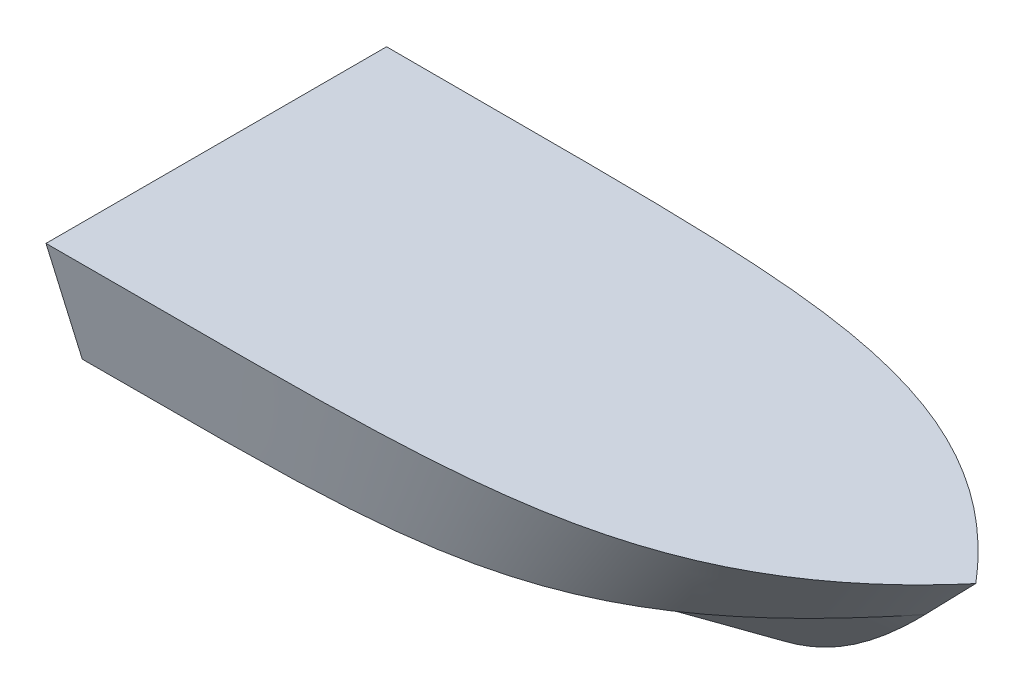
ISO-10303-21;
HEADER;
FILE_DESCRIPTION(('STEP AP214'),'2;1');
FILE_NAME('part.step','',(''),(''),'','','');
FILE_SCHEMA(('AUTOMOTIVE_DESIGN { 1 0 10303 214 1 1 1 1 }'));
ENDSEC;
DATA;
#1=APPLICATION_CONTEXT('core data for automotive mechanical design processes');
#2=APPLICATION_PROTOCOL_DEFINITION('international standard','automotive_design',2000,#1);
#3=PRODUCT_CONTEXT('',#1,'mechanical');
#4=PRODUCT('Part','Part','',(#3));
#5=PRODUCT_RELATED_PRODUCT_CATEGORY('part','',(#4));
#6=PRODUCT_DEFINITION_FORMATION('','',#4);
#7=PRODUCT_DEFINITION_CONTEXT('part definition',#1,'design');
#8=PRODUCT_DEFINITION('design','',#6,#7);
#9=PRODUCT_DEFINITION_SHAPE('','',#8);
#10=(LENGTH_UNIT() NAMED_UNIT(*) SI_UNIT(.MILLI.,.METRE.));
#11=(NAMED_UNIT(*) PLANE_ANGLE_UNIT() SI_UNIT($,.RADIAN.));
#12=(NAMED_UNIT(*) SI_UNIT($,.STERADIAN.) SOLID_ANGLE_UNIT());
#13=UNCERTAINTY_MEASURE_WITH_UNIT(LENGTH_MEASURE(1.E-05),#10,'distance_accuracy_value','');
#14=(GEOMETRIC_REPRESENTATION_CONTEXT(3) GLOBAL_UNCERTAINTY_ASSIGNED_CONTEXT((#13)) GLOBAL_UNIT_ASSIGNED_CONTEXT((#10,
#11,#12)) REPRESENTATION_CONTEXT('',''));
#15=CARTESIAN_POINT('',(0.,0.,0.));
#16=DIRECTION('',(0.,0.,1.));
#17=DIRECTION('',(1.,0.,0.));
#18=AXIS2_PLACEMENT_3D('',#15,#16,#17);
#19=CARTESIAN_POINT('',(3126.38132717579,975.137042122445,1.4531255390156));
#20=CARTESIAN_POINT('',(3126.38132717579,975.59564461762,0.0131255390155955));
#21=CARTESIAN_POINT('',(3126.38132717579,1021.45589413516,-143.986874460984));
#22=CARTESIAN_POINT('',(3681.07733472291,975.137042122445,1.4531255390156));
#23=CARTESIAN_POINT('',(3677.18132717579,975.59564461762,0.0131255390155955));
#24=CARTESIAN_POINT('',(3287.58057246419,1021.45589413516,-143.986874460984));
#25=CARTESIAN_POINT('',(3741.27734227003,975.137042122445,1.4531255390156));
#26=CARTESIAN_POINT('',(3738.38132717579,975.59564461762,0.0131255390155955));
#27=CARTESIAN_POINT('',(3448.77981775258,1021.45589413516,-143.986874460985));
#28=CARTESIAN_POINT('',(3801.47734981714,975.137042122445,1.4531255390156));
#29=CARTESIAN_POINT('',(3799.58132717579,975.59564461762,0.0131255390155955));
#30=CARTESIAN_POINT('',(3609.97906304097,1021.45589413516,-143.986874460984));
#31=CARTESIAN_POINT('',(3861.67735736426,974.790890222072,1.4531255390156));
#32=CARTESIAN_POINT('',(3860.78132717579,975.59564461762,0.0131255390155955));
#33=CARTESIAN_POINT('',(3771.17830832936,1056.07108417245,-143.986874460984));
#34=CARTESIAN_POINT('',(3983.18132717579,1101.59564461762,0.0131255390155955));
#35=CARTESIAN_POINT('',(3983.18132717579,1101.59564461762,0.0131255390155955));
#36=CARTESIAN_POINT('',(3983.18132717579,1101.59564461762,0.0131255390155955));
#37=B_SPLINE_SURFACE_WITH_KNOTS('',5,1,((#19,#20,#21),(#22,#23,#24),(#25,#26,#27),(#28,#29,#30),
(#31,#32,#33),(#34,#35,#36)),.UNSPECIFIED.,.F.,.F.,.F.,(6,6),(2,1,2),(0.,8897.05627484771),
(-12.7701332697109,0.,1277.01332697109),.UNSPECIFIED.);
#38=CARTESIAN_POINT('',(3202.58132717579,983.684883074159,-25.3867423808738));
#39=CARTESIAN_POINT('',(3202.58132717579,980.988471055763,-16.9201194859876));
#40=CARTESIAN_POINT('',(3202.58132717579,978.292059037366,-8.45349659110136));
#41=CARTESIAN_POINT('',(3202.58132717579,975.59564701897,0.0131263037848661));
#42=B_SPLINE_CURVE_WITH_KNOTS('',3,(#38,#39,#40,#41),.UNSPECIFIED.,.F.,.F.,(4,4),(0.,
26.6568765828721),.UNSPECIFIED.);
#43=CARTESIAN_POINT('',(3202.58132717579,983.68484488364,-25.3867545436529));
#44=VERTEX_POINT('',#43);
#45=CARTESIAN_POINT('',(3202.58132717579,975.59564701897,0.0131255390154215));
#46=VERTEX_POINT('',#45);
#47=EDGE_CURVE('E70',#44,#46,#42,.T.);
#48=CARTESIAN_POINT('',(3202.5813271757,983.684921264972,-25.3868622981204));
#49=CARTESIAN_POINT('',(3199.5604793122,983.684914285715,-25.3868629841229));
#50=CARTESIAN_POINT('',(3196.5396314487,983.684908698163,-25.386863613535));
#51=CARTESIAN_POINT('',(3190.45501729085,983.684899582818,-25.3868647986574));
#52=CARTESIAN_POINT('',(3187.3912509965,983.684896085415,-25.3868653531936));
#53=CARTESIAN_POINT('',(3181.2202434461,983.684890548577,-25.3868664178219));
#54=CARTESIAN_POINT('',(3178.11300219004,983.684888530533,-25.3868669271717));
#55=CARTESIAN_POINT('',(3171.85448341421,983.684885493271,-25.3868679199163));
#56=CARTESIAN_POINT('',(3168.70320589443,983.684884488613,-25.386868402841));
#57=CARTESIAN_POINT('',(3162.3560484944,983.684883101906,-25.3868693557301));
#58=CARTESIAN_POINT('',(3159.16016861416,983.684882728869,-25.3868698254144));
#59=CARTESIAN_POINT('',(3152.72323557821,983.684882324725,-25.3868707594717));
#60=CARTESIAN_POINT('',(3149.4821824225,983.684882298526,-25.3868712236759));
#61=CARTESIAN_POINT('',(3142.95432707883,983.684882386962,-25.3868721507675));
#62=CARTESIAN_POINT('',(3139.66752489086,983.684882503591,-25.3868726135437));
#63=CARTESIAN_POINT('',(3133.04759086053,983.684882781469,-25.386873538859));
#64=CARTESIAN_POINT('',(3129.71445901816,983.684882943326,-25.3868740013027));
#65=CARTESIAN_POINT('',(3126.38132717579,983.684883074187,-25.3868744609844));
#66=B_SPLINE_CURVE_WITH_KNOTS('',3,(#48,#49,#50,#51,#52,#53,#54,#55,#56,#57,#58,#59,#60,#61,#62,
#63,#64,#65),.UNSPECIFIED.,.F.,.F.,(4,2,2,2,2,2,2,2,4),(0.,9.06254359051395,18.2538424735734,
27.5755662417392,37.0293988010793,46.6170384418139,56.3401979089336,66.2006044728311,
76.1999999999344),.UNSPECIFIED.);
#67=CARTESIAN_POINT('',(3126.38132717579,983.684883074187,-25.3868744609844));
#68=VERTEX_POINT('',#67);
#69=EDGE_CURVE('E12',#44,#68,#66,.T.);
#70=DIRECTION('',(0.,-0.303456417365817,0.952845319429918));
#71=VECTOR('',#70,1.);
#72=CARTESIAN_POINT('',(3126.38132717579,1021.45589413516,-143.986874460984));
#73=LINE('',#72,#71);
#74=CARTESIAN_POINT('',(3126.38132717579,1021.45589413516,-143.986874460984));
#75=VERTEX_POINT('',#74);
#76=EDGE_CURVE('E131',#75,#68,#73,.T.);
#77=CARTESIAN_POINT('',(3126.38132717579,1021.45589413516,-143.986874460984));
#78=CARTESIAN_POINT('',(3287.58057246419,1021.45589413516,-143.986874460984));
#79=CARTESIAN_POINT('',(3448.77981775258,1021.45589413516,-143.986874460985));
#80=CARTESIAN_POINT('',(3609.97906304097,1021.45589413516,-143.986874460984));
#81=CARTESIAN_POINT('',(3771.17830832936,1056.07108417245,-143.986874460984));
#82=CARTESIAN_POINT('',(3983.18132717579,1101.59564461762,0.0131255390155955));
#83=B_SPLINE_CURVE_WITH_KNOTS('',5,(#77,#78,#79,#80,#81,#82),.UNSPECIFIED.,.F.,.F.,(6,6),(0.,
8897.05627484771),.UNSPECIFIED.);
#84=CARTESIAN_POINT('',(3983.18132717579,1101.59564461762,0.0131255390155955));
#85=VERTEX_POINT('',#84);
#86=EDGE_CURVE('E121',#85,#75,#83,.F.);
#87=CARTESIAN_POINT('',(3126.38132717579,975.59564461762,0.0131255390155955));
#88=CARTESIAN_POINT('',(3677.18132717579,975.59564461762,0.0131255390155955));
#89=CARTESIAN_POINT('',(3738.38132717579,975.59564461762,0.0131255390155955));
#90=CARTESIAN_POINT('',(3799.58132717579,975.59564461762,0.0131255390155955));
#91=CARTESIAN_POINT('',(3860.78132717579,975.59564461762,0.0131255390155955));
#92=CARTESIAN_POINT('',(3983.18132717579,1101.59564461762,0.0131255390155955));
#93=B_SPLINE_CURVE_WITH_KNOTS('',5,(#87,#88,#89,#90,#91,#92),.UNSPECIFIED.,.F.,.F.,(6,6),(0.,
8897.05627484771),.UNSPECIFIED.);
#94=EDGE_CURVE('E137',#46,#85,#93,.T.);
#95=ORIENTED_EDGE('',*,*,#47,.F.);
#96=ORIENTED_EDGE('',*,*,#69,.T.);
#97=ORIENTED_EDGE('',*,*,#76,.F.);
#98=ORIENTED_EDGE('',*,*,#86,.F.);
#99=ORIENTED_EDGE('',*,*,#94,.F.);
#100=EDGE_LOOP('',(#95,#96,#97,#98,#99));
#101=FACE_BOUND('',#100,.T.);
#102=ADVANCED_FACE('F53',(#101),#37,.F.);
#103=CARTESIAN_POINT('',(3126.38132717579,975.59564461762,0.0131255390155955));
#104=DIRECTION('',(1.,0.,0.));
#105=DIRECTION('',(0.,0.,-1.));
#106=AXIS2_PLACEMENT_3D('',#103,#104,#105);
#107=PLANE('',#106);
#108=DIRECTION('',(0.,0.,1.));
#109=VECTOR('',#108,1.);
#110=CARTESIAN_POINT('',(3126.38132717579,983.684883074187,-25.3868744609844));
#111=LINE('',#110,#109);
#112=CARTESIAN_POINT('',(3126.38132717579,983.684883074187,25.4131255390156));
#113=VERTEX_POINT('',#112);
#114=EDGE_CURVE('E116',#68,#113,#111,.T.);
#115=ORIENTED_EDGE('',*,*,#114,.T.);
#116=DIRECTION('',(0.,-0.303456417365817,-0.952845319429918));
#117=VECTOR('',#116,1.);
#118=CARTESIAN_POINT('',(3126.38132717579,1021.45589413516,144.013125539016));
#119=LINE('',#118,#117);
#120=CARTESIAN_POINT('',(3126.38132717579,1021.45589413516,144.013125539016));
#121=VERTEX_POINT('',#120);
#122=EDGE_CURVE('E128',#121,#113,#119,.T.);
#123=ORIENTED_EDGE('',*,*,#122,.F.);
#124=DIRECTION('',(0.,0.,-1.));
#125=VECTOR('',#124,1.);
#126=CARTESIAN_POINT('',(3126.38132717579,1021.45589413516,162.013125539016));
#127=LINE('',#126,#125);
#128=CARTESIAN_POINT('',(3126.38132717579,1021.45589413516,162.013125539016));
#129=VERTEX_POINT('',#128);
#130=EDGE_CURVE('E163',#129,#121,#127,.T.);
#131=ORIENTED_EDGE('',*,*,#130,.F.);
#132=DIRECTION('',(0.,-0.956171796943736,-0.292806240933126));
#133=VECTOR('',#132,1.);
#134=CARTESIAN_POINT('',(3126.38132717579,1093.02576937639,183.929800137054));
#135=LINE('',#134,#133);
#136=CARTESIAN_POINT('',(3126.38132717579,1164.59564461762,205.846474735093));
#137=VERTEX_POINT('',#136);
#138=EDGE_CURVE('E173',#137,#129,#135,.T.);
#139=ORIENTED_EDGE('',*,*,#138,.F.);
#140=DIRECTION('',(0.,0.,1.));
#141=VECTOR('',#140,1.);
#142=CARTESIAN_POINT('',(3126.38132717579,1164.59564461762,0.0131255390155955));
#143=LINE('',#142,#141);
#144=CARTESIAN_POINT('',(3126.38132717579,1164.59564461762,-205.820223657062));
#145=VERTEX_POINT('',#144);
#146=EDGE_CURVE('E182',#145,#137,#143,.T.);
#147=ORIENTED_EDGE('',*,*,#146,.F.);
#148=DIRECTION('',(0.,-0.956171796943736,0.292806240933126));
#149=VECTOR('',#148,1.);
#150=CARTESIAN_POINT('',(3126.38132717579,1093.02576937639,-183.903549059023));
#151=LINE('',#150,#149);
#152=CARTESIAN_POINT('',(3126.38132717579,1021.45589413516,-161.986874460984));
#153=VERTEX_POINT('',#152);
#154=EDGE_CURVE('E141',#145,#153,#151,.T.);
#155=ORIENTED_EDGE('',*,*,#154,.T.);
#156=DIRECTION('',(0.,0.,1.));
#157=VECTOR('',#156,1.);
#158=CARTESIAN_POINT('',(3126.38132717579,1021.45589413516,-161.986874460984));
#159=LINE('',#158,#157);
#160=EDGE_CURVE('E186',#153,#75,#159,.T.);
#161=ORIENTED_EDGE('',*,*,#160,.T.);
#162=ORIENTED_EDGE('',*,*,#76,.T.);
#163=EDGE_LOOP('',(#115,#123,#131,#139,#147,#155,#161,#162));
#164=FACE_BOUND('',#163,.T.);
#165=ADVANCED_FACE('F127',(#164),#107,.F.);
#166=CARTESIAN_POINT('',(3126.38132717579,975.59564461762,0.0131255390155955));
#167=CARTESIAN_POINT('',(3126.38132717579,1021.45589413516,144.013125539016));
#168=CARTESIAN_POINT('',(3677.18132717579,975.59564461762,0.0131255390155955));
#169=CARTESIAN_POINT('',(3287.58057246419,1021.45589413516,144.013125539016));
#170=CARTESIAN_POINT('',(3738.38132717579,975.59564461762,0.0131255390155955));
#171=CARTESIAN_POINT('',(3448.77981775258,1021.45589413516,144.013125539016));
#172=CARTESIAN_POINT('',(3799.58132717579,975.59564461762,0.0131255390155955));
#173=CARTESIAN_POINT('',(3609.97906304097,1021.45589413516,144.013125539016));
#174=CARTESIAN_POINT('',(3860.78132717579,975.59564461762,0.0131255390155955));
#175=CARTESIAN_POINT('',(3771.17830832936,1056.07108417245,144.013125539016));
#176=CARTESIAN_POINT('',(3983.18132717579,1101.59564461762,0.0131255390155955));
#177=CARTESIAN_POINT('',(3983.18132717579,1101.59564461762,0.0131255390155955));
#178=B_SPLINE_SURFACE_WITH_KNOTS('',5,1,((#166,#167),(#168,#169),(#170,#171),(#172,#173),(#174,
#175),(#176,#177)),.UNSPECIFIED.,.F.,.F.,.F.,(6,6),(2,2),(0.,8897.05627484771),(0.,
1277.01332697109),.UNSPECIFIED.);
#179=CARTESIAN_POINT('',(3126.38132717579,983.684883074187,25.4131255390156));
#180=CARTESIAN_POINT('',(3129.71445901816,983.684882943326,25.4131250793339));
#181=CARTESIAN_POINT('',(3133.04759086053,983.684882781469,25.4131246168902));
#182=CARTESIAN_POINT('',(3139.66752489086,983.68488250359,25.4131236915749));
#183=CARTESIAN_POINT('',(3142.95432707883,983.684882386962,25.4131232287986));
#184=CARTESIAN_POINT('',(3149.4821824225,983.684882298526,25.4131223017071));
#185=CARTESIAN_POINT('',(3152.72323557821,983.684882324725,25.4131218375029));
#186=CARTESIAN_POINT('',(3159.16016861416,983.684882728869,25.4131209034456));
#187=CARTESIAN_POINT('',(3162.3560484944,983.684883101905,25.4131204337614));
#188=CARTESIAN_POINT('',(3168.70320589443,983.684884488614,25.4131194808722));
#189=CARTESIAN_POINT('',(3171.85448341421,983.684885493272,25.4131189979475));
#190=CARTESIAN_POINT('',(3178.11300219004,983.684888530533,25.4131180052029));
#191=CARTESIAN_POINT('',(3181.2202434461,983.684890548576,25.4131174958532));
#192=CARTESIAN_POINT('',(3187.3912509965,983.684896085415,25.4131164312249));
#193=CARTESIAN_POINT('',(3190.45501729085,983.684899582818,25.4131158766887));
#194=CARTESIAN_POINT('',(3196.5396314487,983.684908698163,25.4131146915662));
#195=CARTESIAN_POINT('',(3199.5604793122,983.684914285715,25.4131140621541));
#196=CARTESIAN_POINT('',(3202.5813271757,983.684921264972,25.4131133761517));
#197=B_SPLINE_CURVE_WITH_KNOTS('',3,(#179,#180,#181,#182,#183,#184,#185,#186,#187,#188,#189,
#190,#191,#192,#193,#194,#195,#196),.UNSPECIFIED.,.F.,.F.,(4,2,2,2,2,2,2,2,4),(0.,
9.99939552710327,19.8598020910012,29.5829615581205,39.1706011988542,48.6244337581956,
57.9461575263601,67.1374564094196,76.1999999999344),.UNSPECIFIED.);
#198=CARTESIAN_POINT('',(3202.58132717575,983.684890281387,25.4130821290207));
#199=VERTEX_POINT('',#198);
#200=EDGE_CURVE('E112',#199,#113,#197,.F.);
#201=CARTESIAN_POINT('',(3202.58132717579,983.684909376712,25.4130760476099));
#202=CARTESIAN_POINT('',(3202.58132717579,980.988488590798,16.9464256231553));
#203=CARTESIAN_POINT('',(3202.58132717579,978.292067804884,8.47977519870063));
#204=CARTESIAN_POINT('',(3202.58132717579,975.59564701897,0.013124774245977));
#205=B_SPLINE_CURVE_WITH_KNOTS('',3,(#201,#202,#203,#204),.UNSPECIFIED.,.F.,.F.,(4,4),(0.,
26.6569632588121),.UNSPECIFIED.);
#206=EDGE_CURVE('E122',#199,#46,#205,.T.);
#207=CARTESIAN_POINT('',(3126.38132717579,1021.45589413516,144.013125539016));
#208=CARTESIAN_POINT('',(3287.58057246419,1021.45589413516,144.013125539016));
#209=CARTESIAN_POINT('',(3448.77981775258,1021.45589413516,144.013125539016));
#210=CARTESIAN_POINT('',(3609.97906304097,1021.45589413516,144.013125539016));
#211=CARTESIAN_POINT('',(3771.17830832936,1056.07108417245,144.013125539016));
#212=CARTESIAN_POINT('',(3983.18132717579,1101.59564461762,0.0131255390155955));
#213=B_SPLINE_CURVE_WITH_KNOTS('',5,(#207,#208,#209,#210,#211,#212),.UNSPECIFIED.,.F.,.F.,(6,6),
(0.,8897.05627484771),.UNSPECIFIED.);
#214=EDGE_CURVE('E136',#85,#121,#213,.F.);
#215=ORIENTED_EDGE('',*,*,#200,.F.);
#216=ORIENTED_EDGE('',*,*,#206,.T.);
#217=ORIENTED_EDGE('',*,*,#94,.T.);
#218=ORIENTED_EDGE('',*,*,#214,.T.);
#219=ORIENTED_EDGE('',*,*,#122,.T.);
#220=EDGE_LOOP('',(#215,#216,#217,#218,#219));
#221=FACE_BOUND('',#220,.T.);
#222=ADVANCED_FACE('F134',(#221),#178,.T.);
#223=CARTESIAN_POINT('',(3126.38132717579,1021.45589413516,144.013125539016));
#224=CARTESIAN_POINT('',(3126.38132717579,1021.45589413516,162.013125539016));
#225=CARTESIAN_POINT('',(3287.58057246419,1021.45589413516,144.013125539015));
#226=CARTESIAN_POINT('',(3287.58057246419,1021.45589413516,162.013125539015));
#227=CARTESIAN_POINT('',(3448.77981775258,1021.45589413516,144.013125539016));
#228=CARTESIAN_POINT('',(3448.77981775258,1021.45589413516,162.013125539016));
#229=CARTESIAN_POINT('',(3609.97906304097,1021.45589413516,144.013125539016));
#230=CARTESIAN_POINT('',(3609.97906304097,1021.45589413516,162.013125539015));
#231=CARTESIAN_POINT('',(3771.17830832936,1056.07108417245,144.013125539016));
#232=CARTESIAN_POINT('',(3771.17830832936,1056.07108417245,162.013125539016));
#233=CARTESIAN_POINT('',(3983.18132717579,1101.59564461762,0.0131255390155955));
#234=CARTESIAN_POINT('',(3983.18132717579,1101.59564461762,0.0131255390155955));
#235=B_SPLINE_SURFACE_WITH_KNOTS('',5,1,((#223,#224),(#225,#226),(#227,#228),(#229,#230),(#231,
#232),(#233,#234)),.UNSPECIFIED.,.F.,.F.,.F.,(6,6),(2,2),(0.,8794.40554991982),(0.,150.),.UNSPECIFIED.);
#236=CARTESIAN_POINT('',(3126.38132717579,1021.45589413516,162.013125539016));
#237=CARTESIAN_POINT('',(3287.58057246419,1021.45589413516,162.013125539015));
#238=CARTESIAN_POINT('',(3448.77981775258,1021.45589413516,162.013125539016));
#239=CARTESIAN_POINT('',(3609.97906304097,1021.45589413516,162.013125539015));
#240=CARTESIAN_POINT('',(3771.17830832936,1056.07108417245,162.013125539016));
#241=CARTESIAN_POINT('',(3983.18132717579,1101.59564461762,0.0131255390155955));
#242=B_SPLINE_CURVE_WITH_KNOTS('',5,(#236,#237,#238,#239,#240,#241),.UNSPECIFIED.,.F.,.F.,(6,6),
(0.,8794.40554991982),.UNSPECIFIED.);
#243=EDGE_CURVE('E139',#85,#129,#242,.F.);
#244=ORIENTED_EDGE('',*,*,#243,.T.);
#245=ORIENTED_EDGE('',*,*,#130,.T.);
#246=ORIENTED_EDGE('',*,*,#214,.F.);
#247=EDGE_LOOP('',(#244,#245,#246));
#248=FACE_BOUND('',#247,.T.);
#249=ADVANCED_FACE('F233',(#248),#235,.T.);
#250=CARTESIAN_POINT('',(3126.38132717579,1021.45589413516,162.013125539016));
#251=CARTESIAN_POINT('',(3126.38132717579,1093.02576937639,183.929800137054));
#252=CARTESIAN_POINT('',(3126.38132717579,1164.59564461762,205.846474735093));
#253=CARTESIAN_POINT('',(3287.58057246419,1021.45589413516,162.013125539016));
#254=CARTESIAN_POINT('',(3299.86115646791,1093.02576937639,183.929800137054));
#255=CARTESIAN_POINT('',(3312.14174047163,1164.59564461762,205.846474735093));
#256=CARTESIAN_POINT('',(3448.77981775258,1021.45589413516,162.013125539016));
#257=CARTESIAN_POINT('',(3473.34098576002,1093.02576937639,183.929800137054));
#258=CARTESIAN_POINT('',(3497.90215376746,1164.59564461762,205.846474735093));
#259=CARTESIAN_POINT('',(3609.97906304097,1021.45589413516,162.013125539016));
#260=CARTESIAN_POINT('',(3646.82081505213,1093.02576937639,183.929800137054));
#261=CARTESIAN_POINT('',(3683.66256706329,1164.59564461762,205.846474735093));
#262=CARTESIAN_POINT('',(3771.17830832936,1056.07108417245,162.013125539016));
#263=CARTESIAN_POINT('',(3820.30064434424,1110.33336439503,183.929800137054));
#264=CARTESIAN_POINT('',(3869.42298035913,1164.59564461762,205.846474735093));
#265=CARTESIAN_POINT('',(3983.18132717579,1101.59564461762,0.0131255390155955));
#266=CARTESIAN_POINT('',(4013.78132717579,1133.09564461762,0.0131255390155955));
#267=CARTESIAN_POINT('',(4044.38132717579,1164.59564461762,0.0131255390155955));
#268=B_SPLINE_SURFACE_WITH_KNOTS('',5,2,((#250,#251,#252),(#253,#254,#255),(#256,#257,#258),
(#259,#260,#261),(#262,#263,#264),(#265,#266,#267)),.UNSPECIFIED.,.F.,.F.,.F.,(6,6),(3,3),(0.,
9710.49137354744),(0.,1411.32546804126),.UNSPECIFIED.);
#269=CARTESIAN_POINT('',(3126.38132717579,1164.59564461762,205.846474735093));
#270=CARTESIAN_POINT('',(3312.14174047163,1164.59564461762,205.846474735093));
#271=CARTESIAN_POINT('',(3497.90215376746,1164.59564461762,205.846474735093));
#272=CARTESIAN_POINT('',(3683.66256706329,1164.59564461762,205.846474735093));
#273=CARTESIAN_POINT('',(3869.42298035913,1164.59564461762,205.846474735093));
#274=CARTESIAN_POINT('',(4044.38132717579,1164.59564461762,0.0131255390155955));
#275=B_SPLINE_CURVE_WITH_KNOTS('',5,(#269,#270,#271,#272,#273,#274),.UNSPECIFIED.,.F.,.F.,(6,6),
(0.,9710.49137354744),.UNSPECIFIED.);
#276=CARTESIAN_POINT('',(4044.38132717579,1164.59564461762,0.0131255390155955));
#277=VERTEX_POINT('',#276);
#278=EDGE_CURVE('E168',#277,#137,#275,.F.);
#279=DIRECTION('',(0.696785684263246,0.71727938085923,0.));
#280=VECTOR('',#279,1.);
#281=CARTESIAN_POINT('',(4013.78132717579,1133.09564461762,0.0131255390155955));
#282=LINE('',#281,#280);
#283=EDGE_CURVE('E179',#85,#277,#282,.T.);
#284=ORIENTED_EDGE('',*,*,#278,.T.);
#285=ORIENTED_EDGE('',*,*,#138,.T.);
#286=ORIENTED_EDGE('',*,*,#243,.F.);
#287=ORIENTED_EDGE('',*,*,#283,.T.);
#288=EDGE_LOOP('',(#284,#285,#286,#287));
#289=FACE_BOUND('',#288,.T.);
#290=ADVANCED_FACE('F284',(#289),#268,.T.);
#291=CARTESIAN_POINT('',(4044.38142917579,1164.59564461762,0.0131255390155955));
#292=DIRECTION('',(0.,-1.,0.));
#293=DIRECTION('',(0.,0.,-1.));
#294=AXIS2_PLACEMENT_3D('',#291,#292,#293);
#295=PLANE('',#294);
#296=ORIENTED_EDGE('',*,*,#278,.F.);
#297=CARTESIAN_POINT('',(3126.38132717579,1164.59564461762,-205.820223657062));
#298=CARTESIAN_POINT('',(3312.14174047163,1164.59564461762,-205.820223657062));
#299=CARTESIAN_POINT('',(3497.90215376746,1164.59564461762,-205.820223657062));
#300=CARTESIAN_POINT('',(3683.66256706329,1164.59564461762,-205.820223657062));
#301=CARTESIAN_POINT('',(3869.42298035913,1164.59564461762,-205.820223657062));
#302=CARTESIAN_POINT('',(4044.38132717579,1164.59564461762,0.0131255390155955));
#303=B_SPLINE_CURVE_WITH_KNOTS('',5,(#297,#298,#299,#300,#301,#302),.UNSPECIFIED.,.F.,.F.,(6,6),
(0.,9710.49137354744),.UNSPECIFIED.);
#304=EDGE_CURVE('E185',#277,#145,#303,.F.);
#305=ORIENTED_EDGE('',*,*,#304,.T.);
#306=ORIENTED_EDGE('',*,*,#146,.T.);
#307=EDGE_LOOP('',(#296,#305,#306));
#308=FACE_BOUND('',#307,.T.);
#309=ADVANCED_FACE('F261',(#308),#295,.F.);
#310=CARTESIAN_POINT('',(3126.38132717579,1021.45589413516,-143.986874460984));
#311=CARTESIAN_POINT('',(3126.38132717579,1021.45589413516,-161.986874460984));
#312=CARTESIAN_POINT('',(3287.58057246419,1021.45589413516,-143.986874460984));
#313=CARTESIAN_POINT('',(3287.58057246419,1021.45589413516,-161.986874460984));
#314=CARTESIAN_POINT('',(3448.77981775258,1021.45589413516,-143.986874460985));
#315=CARTESIAN_POINT('',(3448.77981775258,1021.45589413516,-161.986874460985));
#316=CARTESIAN_POINT('',(3609.97906304097,1021.45589413516,-143.986874460984));
#317=CARTESIAN_POINT('',(3609.97906304097,1021.45589413516,-161.986874460984));
#318=CARTESIAN_POINT('',(3771.17830832936,1056.07108417245,-143.986874460984));
#319=CARTESIAN_POINT('',(3771.17830832936,1056.07108417245,-161.986874460985));
#320=CARTESIAN_POINT('',(3983.18132717579,1101.59564461762,0.0131255390155955));
#321=CARTESIAN_POINT('',(3983.18132717579,1101.59564461762,0.0131255390155955));
#322=B_SPLINE_SURFACE_WITH_KNOTS('',5,1,((#310,#311),(#312,#313),(#314,#315),(#316,#317),(#318,
#319),(#320,#321)),.UNSPECIFIED.,.F.,.F.,.F.,(6,6),(2,2),(0.,8794.40554991982),(0.,150.),.UNSPECIFIED.);
#323=CARTESIAN_POINT('',(3126.38132717579,1021.45589413516,-161.986874460984));
#324=CARTESIAN_POINT('',(3287.58057246419,1021.45589413516,-161.986874460984));
#325=CARTESIAN_POINT('',(3448.77981775258,1021.45589413516,-161.986874460985));
#326=CARTESIAN_POINT('',(3609.97906304097,1021.45589413516,-161.986874460984));
#327=CARTESIAN_POINT('',(3771.17830832936,1056.07108417245,-161.986874460985));
#328=CARTESIAN_POINT('',(3983.18132717579,1101.59564461762,0.0131255390155955));
#329=B_SPLINE_CURVE_WITH_KNOTS('',5,(#323,#324,#325,#326,#327,#328),.UNSPECIFIED.,.F.,.F.,(6,6),
(0.,8794.40554991982),.UNSPECIFIED.);
#330=EDGE_CURVE('E188',#85,#153,#329,.F.);
#331=ORIENTED_EDGE('',*,*,#330,.F.);
#332=ORIENTED_EDGE('',*,*,#86,.T.);
#333=ORIENTED_EDGE('',*,*,#160,.F.);
#334=EDGE_LOOP('',(#331,#332,#333));
#335=FACE_BOUND('',#334,.T.);
#336=ADVANCED_FACE('F263',(#335),#322,.F.);
#337=CARTESIAN_POINT('',(3126.38132717579,1021.45589413516,-161.986874460984));
#338=CARTESIAN_POINT('',(3126.38132717579,1093.02576937639,-183.903549059022));
#339=CARTESIAN_POINT('',(3126.38132717579,1164.59564461762,-205.820223657062));
#340=CARTESIAN_POINT('',(3287.58057246419,1021.45589413516,-161.986874460984));
#341=CARTESIAN_POINT('',(3299.86115646791,1093.02576937639,-183.903549059022));
#342=CARTESIAN_POINT('',(3312.14174047163,1164.59564461762,-205.820223657062));
#343=CARTESIAN_POINT('',(3448.77981775258,1021.45589413516,-161.986874460984));
#344=CARTESIAN_POINT('',(3473.34098576002,1093.02576937639,-183.903549059023));
#345=CARTESIAN_POINT('',(3497.90215376746,1164.59564461762,-205.820223657062));
#346=CARTESIAN_POINT('',(3609.97906304097,1021.45589413516,-161.986874460984));
#347=CARTESIAN_POINT('',(3646.82081505213,1093.02576937639,-183.903549059023));
#348=CARTESIAN_POINT('',(3683.66256706329,1164.59564461762,-205.820223657062));
#349=CARTESIAN_POINT('',(3771.17830832936,1056.07108417245,-161.986874460984));
#350=CARTESIAN_POINT('',(3820.30064434424,1110.33336439503,-183.903549059023));
#351=CARTESIAN_POINT('',(3869.42298035913,1164.59564461762,-205.820223657062));
#352=CARTESIAN_POINT('',(3983.18132717579,1101.59564461762,0.0131255390155955));
#353=CARTESIAN_POINT('',(4013.78132717579,1133.09564461762,0.0131255390155955));
#354=CARTESIAN_POINT('',(4044.38132717579,1164.59564461762,0.0131255390155955));
#355=B_SPLINE_SURFACE_WITH_KNOTS('',5,2,((#337,#338,#339),(#340,#341,#342),(#343,#344,#345),
(#346,#347,#348),(#349,#350,#351),(#352,#353,#354)),.UNSPECIFIED.,.F.,.F.,.F.,(6,6),(3,3),(0.,
9710.49137354744),(0.,1411.32546804126),.UNSPECIFIED.);
#356=ORIENTED_EDGE('',*,*,#304,.F.);
#357=ORIENTED_EDGE('',*,*,#283,.F.);
#358=ORIENTED_EDGE('',*,*,#330,.T.);
#359=ORIENTED_EDGE('',*,*,#154,.F.);
#360=EDGE_LOOP('',(#356,#357,#358,#359));
#361=FACE_BOUND('',#360,.T.);
#362=ADVANCED_FACE('F55',(#361),#355,.F.);
#363=CARTESIAN_POINT('',(3202.58132717579,983.684883074187,-25.3868744609844));
#364=DIRECTION('',(0.,-1.,0.));
#365=DIRECTION('',(0.,0.,-1.));
#366=AXIS2_PLACEMENT_3D('',#363,#364,#365);
#367=PLANE('',#366);
#368=ORIENTED_EDGE('',*,*,#114,.F.);
#369=ORIENTED_EDGE('',*,*,#69,.F.);
#370=DIRECTION('',(0.,0.,1.));
#371=VECTOR('',#370,1.);
#372=CARTESIAN_POINT('',(3202.58132717579,983.684883074187,-25.3868744609844));
#373=LINE('',#372,#371);
#374=EDGE_CURVE('E77',#44,#199,#373,.T.);
#375=ORIENTED_EDGE('',*,*,#374,.T.);
#376=ORIENTED_EDGE('',*,*,#200,.T.);
#377=EDGE_LOOP('',(#368,#369,#375,#376));
#378=FACE_BOUND('',#377,.T.);
#379=ADVANCED_FACE('F115',(#378),#367,.T.);
#380=CARTESIAN_POINT('',(3202.58132717579,0.,0.));
#381=DIRECTION('',(1.,0.,0.));
#382=DIRECTION('',(0.,0.,-1.));
#383=AXIS2_PLACEMENT_3D('',#380,#381,#382);
#384=PLANE('',#383);
#385=ORIENTED_EDGE('',*,*,#206,.F.);
#386=ORIENTED_EDGE('',*,*,#374,.F.);
#387=ORIENTED_EDGE('',*,*,#47,.T.);
#388=EDGE_LOOP('',(#385,#386,#387));
#389=FACE_BOUND('',#388,.T.);
#390=ADVANCED_FACE('F218',(#389),#384,.F.);
#391=CLOSED_SHELL('',(#102,#165,#222,#249,#290,#309,#336,#362,#379,#390));
#392=MANIFOLD_SOLID_BREP('B2',#391);
#393=ADVANCED_BREP_SHAPE_REPRESENTATION('',(#18,#392),#14);
#394=SHAPE_DEFINITION_REPRESENTATION(#9,#393);
ENDSEC;
END-ISO-10303-21;
